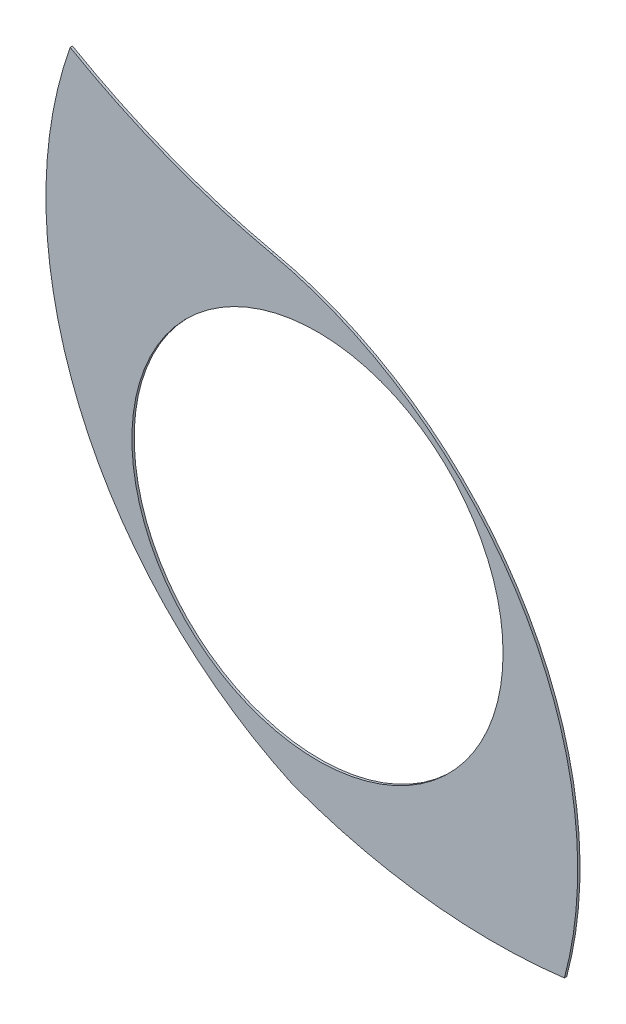
ISO-10303-21;
HEADER;
FILE_DESCRIPTION(('STEP AP214'),'2;1');
FILE_NAME('part.step','',(''),(''),'','','');
FILE_SCHEMA(('AUTOMOTIVE_DESIGN { 1 0 10303 214 1 1 1 1 }'));
ENDSEC;
DATA;
#1=APPLICATION_CONTEXT('core data for automotive mechanical design processes');
#2=APPLICATION_PROTOCOL_DEFINITION('international standard','automotive_design',2000,#1);
#3=PRODUCT_CONTEXT('',#1,'mechanical');
#4=PRODUCT('Part','Part','',(#3));
#5=PRODUCT_RELATED_PRODUCT_CATEGORY('part','',(#4));
#6=PRODUCT_DEFINITION_FORMATION('','',#4);
#7=PRODUCT_DEFINITION_CONTEXT('part definition',#1,'design');
#8=PRODUCT_DEFINITION('design','',#6,#7);
#9=PRODUCT_DEFINITION_SHAPE('','',#8);
#10=(LENGTH_UNIT() NAMED_UNIT(*) SI_UNIT(.MILLI.,.METRE.));
#11=(NAMED_UNIT(*) PLANE_ANGLE_UNIT() SI_UNIT($,.RADIAN.));
#12=(NAMED_UNIT(*) SI_UNIT($,.STERADIAN.) SOLID_ANGLE_UNIT());
#13=UNCERTAINTY_MEASURE_WITH_UNIT(LENGTH_MEASURE(1.E-05),#10,'distance_accuracy_value','');
#14=(GEOMETRIC_REPRESENTATION_CONTEXT(3) GLOBAL_UNCERTAINTY_ASSIGNED_CONTEXT((#13)) GLOBAL_UNIT_ASSIGNED_CONTEXT((#10,
#11,#12)) REPRESENTATION_CONTEXT('',''));
#15=CARTESIAN_POINT('',(0.,0.,0.));
#16=DIRECTION('',(0.,0.,1.));
#17=DIRECTION('',(1.,0.,0.));
#18=AXIS2_PLACEMENT_3D('',#15,#16,#17);
#19=CARTESIAN_POINT('',(17.5252872609987,21.7397398749229,0.1));
#20=DIRECTION('',(0.,0.,1.));
#21=DIRECTION('',(1.,0.,0.));
#22=AXIS2_PLACEMENT_3D('',#19,#20,#21);
#23=PLANE('',#22);
#24=CARTESIAN_POINT('',(24.0995285488142,31.935922679974,0.1));
#25=DIRECTION('',(0.,0.,1.));
#26=DIRECTION('',(1.,0.,0.));
#27=AXIS2_PLACEMENT_3D('',#24,#25,#26);
#28=CIRCLE('',#27,24.9282979751055);
#29=CARTESIAN_POINT('',(15.423765373958,8.56604520341335,0.1));
#30=VERTEX_POINT('',#29);
#31=CARTESIAN_POINT('',(27.1454802396802,7.19441467757933,0.1));
#32=VERTEX_POINT('',#31);
#33=EDGE_CURVE('E85',#30,#32,#28,.T.);
#34=ORIENTED_EDGE('',*,*,#33,.T.);
#35=CARTESIAN_POINT('',(10.9510459731831,11.5435570698718,0.1));
#36=DIRECTION('',(0.,0.,1.));
#37=DIRECTION('',(1.,0.,0.));
#38=AXIS2_PLACEMENT_3D('',#35,#36,#37);
#39=CIRCLE('',#38,16.7682658841137);
#40=CARTESIAN_POINT('',(14.5239648762175,27.926749410581,0.1));
#41=VERTEX_POINT('',#40);
#42=EDGE_CURVE('E80',#32,#41,#39,.T.);
#43=ORIENTED_EDGE('',*,*,#42,.T.);
#44=CARTESIAN_POINT('',(21.1064686033169,57.8480647338155,0.1));
#45=DIRECTION('',(0.,0.,-1.));
#46=DIRECTION('',(1.,0.,0.));
#47=AXIS2_PLACEMENT_3D('',#44,#45,#46);
#48=CIRCLE('',#47,30.6368155327819);
#49=CARTESIAN_POINT('',(5.84112733735697,31.2852369095139,0.1));
#50=VERTEX_POINT('',#49);
#51=EDGE_CURVE('E83',#41,#50,#48,.T.);
#52=ORIENTED_EDGE('',*,*,#51,.T.);
#53=CARTESIAN_POINT('',(23.1053770078891,25.1865491575149,0.1));
#54=DIRECTION('',(0.,0.,1.));
#55=DIRECTION('',(1.,0.,0.));
#56=AXIS2_PLACEMENT_3D('',#53,#54,#55);
#57=CIRCLE('',#56,18.3097872457014);
#58=EDGE_CURVE('E50',#50,#30,#57,.T.);
#59=ORIENTED_EDGE('',*,*,#58,.T.);
#60=EDGE_LOOP('',(#34,#43,#52,#59));
#61=FACE_BOUND('',#60,.T.);
#62=CARTESIAN_POINT('',(16.5014289726563,17.9948918233185,0.1));
#63=DIRECTION('',(0.,0.,1.));
#64=DIRECTION('',(1.,0.,0.));
#65=AXIS2_PLACEMENT_3D('',#62,#63,#64);
#66=CIRCLE('',#65,8.);
#67=CARTESIAN_POINT('',(24.5014289726563,17.9948918233185,0.1));
#68=VERTEX_POINT('',#67);
#69=EDGE_CURVE('E100',#68,#68,#66,.T.);
#70=ORIENTED_EDGE('',*,*,#69,.F.);
#71=EDGE_LOOP('',(#70));
#72=FACE_BOUND('',#71,.T.);
#73=ADVANCED_FACE('F33',(#61,#72),#23,.T.);
#74=CARTESIAN_POINT('',(17.5252872609987,21.7397398749229,0.));
#75=DIRECTION('',(0.,0.,1.));
#76=DIRECTION('',(1.,0.,0.));
#77=AXIS2_PLACEMENT_3D('',#74,#75,#76);
#78=PLANE('',#77);
#79=CARTESIAN_POINT('',(24.0995285488142,31.935922679974,0.));
#80=DIRECTION('',(0.,0.,1.));
#81=DIRECTION('',(1.,0.,0.));
#82=AXIS2_PLACEMENT_3D('',#79,#80,#81);
#83=CIRCLE('',#82,24.9282979751055);
#84=CARTESIAN_POINT('',(15.423765373958,8.56604520341335,0.));
#85=VERTEX_POINT('',#84);
#86=CARTESIAN_POINT('',(27.1454802396802,7.19441467757933,0.));
#87=VERTEX_POINT('',#86);
#88=EDGE_CURVE('E97',#85,#87,#83,.T.);
#89=ORIENTED_EDGE('',*,*,#88,.F.);
#90=CARTESIAN_POINT('',(23.1053770078891,25.1865491575149,0.));
#91=DIRECTION('',(0.,0.,1.));
#92=DIRECTION('',(1.,0.,0.));
#93=AXIS2_PLACEMENT_3D('',#90,#91,#92);
#94=CIRCLE('',#93,18.3097872457014);
#95=CARTESIAN_POINT('',(5.84112733735697,31.2852369095139,0.));
#96=VERTEX_POINT('',#95);
#97=EDGE_CURVE('E73',#96,#85,#94,.T.);
#98=ORIENTED_EDGE('',*,*,#97,.F.);
#99=CARTESIAN_POINT('',(21.1064686033169,57.8480647338155,0.));
#100=DIRECTION('',(0.,0.,-1.));
#101=DIRECTION('',(1.,0.,0.));
#102=AXIS2_PLACEMENT_3D('',#99,#100,#101);
#103=CIRCLE('',#102,30.6368155327819);
#104=CARTESIAN_POINT('',(14.5239648762175,27.926749410581,0.));
#105=VERTEX_POINT('',#104);
#106=EDGE_CURVE('E67',#105,#96,#103,.T.);
#107=ORIENTED_EDGE('',*,*,#106,.F.);
#108=CARTESIAN_POINT('',(10.9510459731831,11.5435570698718,0.));
#109=DIRECTION('',(0.,0.,1.));
#110=DIRECTION('',(1.,0.,0.));
#111=AXIS2_PLACEMENT_3D('',#108,#109,#110);
#112=CIRCLE('',#111,16.7682658841137);
#113=EDGE_CURVE('E89',#87,#105,#112,.T.);
#114=ORIENTED_EDGE('',*,*,#113,.F.);
#115=EDGE_LOOP('',(#89,#98,#107,#114));
#116=FACE_BOUND('',#115,.T.);
#117=CARTESIAN_POINT('',(16.5014289726563,17.9948918233185,0.));
#118=DIRECTION('',(0.,0.,1.));
#119=DIRECTION('',(1.,0.,0.));
#120=AXIS2_PLACEMENT_3D('',#117,#118,#119);
#121=CIRCLE('',#120,8.);
#122=CARTESIAN_POINT('',(24.5014289726563,17.9948918233185,0.));
#123=VERTEX_POINT('',#122);
#124=EDGE_CURVE('E112',#123,#123,#121,.T.);
#125=ORIENTED_EDGE('',*,*,#124,.T.);
#126=EDGE_LOOP('',(#125));
#127=FACE_BOUND('',#126,.T.);
#128=ADVANCED_FACE('F108',(#116,#127),#78,.F.);
#129=CARTESIAN_POINT('',(24.0995285488142,31.935922679974,0.1));
#130=DIRECTION('',(0.,0.,-1.));
#131=DIRECTION('',(-1.,0.,0.));
#132=AXIS2_PLACEMENT_3D('',#129,#130,#131);
#133=CYLINDRICAL_SURFACE('',#132,24.9282979751055);
#134=ORIENTED_EDGE('',*,*,#88,.T.);
#135=DIRECTION('',(0.,0.,-1.));
#136=VECTOR('',#135,1.);
#137=CARTESIAN_POINT('',(27.1454802396802,7.19441467757933,0.1));
#138=LINE('',#137,#136);
#139=EDGE_CURVE('E11',#32,#87,#138,.T.);
#140=ORIENTED_EDGE('',*,*,#139,.F.);
#141=ORIENTED_EDGE('',*,*,#33,.F.);
#142=DIRECTION('',(0.,0.,-1.));
#143=VECTOR('',#142,1.);
#144=CARTESIAN_POINT('',(15.423765373958,8.56604520341335,0.1));
#145=LINE('',#144,#143);
#146=EDGE_CURVE('E93',#30,#85,#145,.T.);
#147=ORIENTED_EDGE('',*,*,#146,.T.);
#148=EDGE_LOOP('',(#134,#140,#141,#147));
#149=FACE_BOUND('',#148,.T.);
#150=ADVANCED_FACE('F35',(#149),#133,.T.);
#151=CARTESIAN_POINT('',(10.9510459731831,11.5435570698718,0.1));
#152=DIRECTION('',(0.,0.,-1.));
#153=DIRECTION('',(-1.,0.,0.));
#154=AXIS2_PLACEMENT_3D('',#151,#152,#153);
#155=CYLINDRICAL_SURFACE('',#154,16.7682658841137);
#156=ORIENTED_EDGE('',*,*,#113,.T.);
#157=DIRECTION('',(0.,0.,-1.));
#158=VECTOR('',#157,1.);
#159=CARTESIAN_POINT('',(14.5239648762175,27.926749410581,0.1));
#160=LINE('',#159,#158);
#161=EDGE_CURVE('E42',#41,#105,#160,.T.);
#162=ORIENTED_EDGE('',*,*,#161,.F.);
#163=ORIENTED_EDGE('',*,*,#42,.F.);
#164=ORIENTED_EDGE('',*,*,#139,.T.);
#165=EDGE_LOOP('',(#156,#162,#163,#164));
#166=FACE_BOUND('',#165,.T.);
#167=ADVANCED_FACE('F88',(#166),#155,.T.);
#168=CARTESIAN_POINT('',(21.1064686033169,57.8480647338155,0.1));
#169=DIRECTION('',(0.,0.,-1.));
#170=DIRECTION('',(-1.,0.,0.));
#171=AXIS2_PLACEMENT_3D('',#168,#169,#170);
#172=CYLINDRICAL_SURFACE('',#171,30.6368155327819);
#173=ORIENTED_EDGE('',*,*,#106,.T.);
#174=DIRECTION('',(0.,0.,-1.));
#175=VECTOR('',#174,1.);
#176=CARTESIAN_POINT('',(5.84112733735697,31.2852369095139,0.1));
#177=LINE('',#176,#175);
#178=EDGE_CURVE('E90',#50,#96,#177,.T.);
#179=ORIENTED_EDGE('',*,*,#178,.F.);
#180=ORIENTED_EDGE('',*,*,#51,.F.);
#181=ORIENTED_EDGE('',*,*,#161,.T.);
#182=EDGE_LOOP('',(#173,#179,#180,#181));
#183=FACE_BOUND('',#182,.T.);
#184=ADVANCED_FACE('F91',(#183),#172,.F.);
#185=CARTESIAN_POINT('',(23.1053770078891,25.1865491575149,0.1));
#186=DIRECTION('',(0.,0.,-1.));
#187=DIRECTION('',(-1.,0.,0.));
#188=AXIS2_PLACEMENT_3D('',#185,#186,#187);
#189=CYLINDRICAL_SURFACE('',#188,18.3097872457014);
#190=ORIENTED_EDGE('',*,*,#97,.T.);
#191=ORIENTED_EDGE('',*,*,#146,.F.);
#192=ORIENTED_EDGE('',*,*,#58,.F.);
#193=ORIENTED_EDGE('',*,*,#178,.T.);
#194=EDGE_LOOP('',(#190,#191,#192,#193));
#195=FACE_BOUND('',#194,.T.);
#196=ADVANCED_FACE('F105',(#195),#189,.T.);
#197=CARTESIAN_POINT('',(16.5014289726563,17.9948918233185,0.1));
#198=DIRECTION('',(0.,0.,-1.));
#199=DIRECTION('',(-1.,0.,0.));
#200=AXIS2_PLACEMENT_3D('',#197,#198,#199);
#201=CYLINDRICAL_SURFACE('',#200,8.);
#202=ORIENTED_EDGE('',*,*,#69,.T.);
#203=EDGE_LOOP('',(#202));
#204=FACE_BOUND('',#203,.T.);
#205=ORIENTED_EDGE('',*,*,#124,.F.);
#206=EDGE_LOOP('',(#205));
#207=FACE_BOUND('',#206,.T.);
#208=ADVANCED_FACE('F118',(#204,#207),#201,.F.);
#209=CLOSED_SHELL('',(#73,#128,#150,#167,#184,#196,#208));
#210=MANIFOLD_SOLID_BREP('B2',#209);
#211=ADVANCED_BREP_SHAPE_REPRESENTATION('',(#18,#210),#14);
#212=SHAPE_DEFINITION_REPRESENTATION(#9,#211);
ENDSEC;
END-ISO-10303-21;
